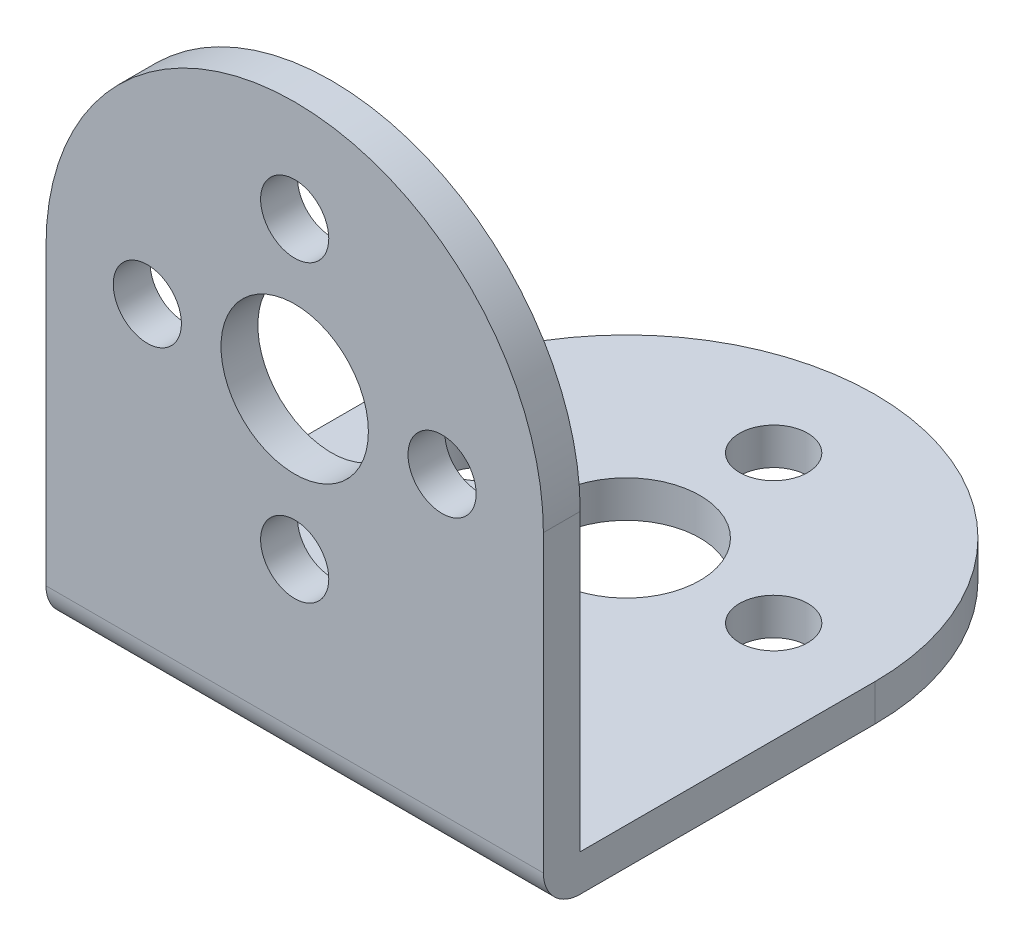
ISO-10303-21;
HEADER;
FILE_DESCRIPTION(('STEP AP214'),'2;1');
FILE_NAME('part.step','',(''),(''),'','','');
FILE_SCHEMA(('AUTOMOTIVE_DESIGN { 1 0 10303 214 1 1 1 1 }'));
ENDSEC;
DATA;
#1=APPLICATION_CONTEXT('core data for automotive mechanical design processes');
#2=APPLICATION_PROTOCOL_DEFINITION('international standard','automotive_design',2000,#1);
#3=PRODUCT_CONTEXT('',#1,'mechanical');
#4=PRODUCT('Part','Part','',(#3));
#5=PRODUCT_RELATED_PRODUCT_CATEGORY('part','',(#4));
#6=PRODUCT_DEFINITION_FORMATION('','',#4);
#7=PRODUCT_DEFINITION_CONTEXT('part definition',#1,'design');
#8=PRODUCT_DEFINITION('design','',#6,#7);
#9=PRODUCT_DEFINITION_SHAPE('','',#8);
#10=(LENGTH_UNIT() NAMED_UNIT(*) SI_UNIT(.MILLI.,.METRE.));
#11=(NAMED_UNIT(*) PLANE_ANGLE_UNIT() SI_UNIT($,.RADIAN.));
#12=(NAMED_UNIT(*) SI_UNIT($,.STERADIAN.) SOLID_ANGLE_UNIT());
#13=UNCERTAINTY_MEASURE_WITH_UNIT(LENGTH_MEASURE(1.E-05),#10,'distance_accuracy_value','');
#14=(GEOMETRIC_REPRESENTATION_CONTEXT(3) GLOBAL_UNCERTAINTY_ASSIGNED_CONTEXT((#13)) GLOBAL_UNIT_ASSIGNED_CONTEXT((#10,
#11,#12)) REPRESENTATION_CONTEXT('',''));
#15=CARTESIAN_POINT('',(0.,0.,0.));
#16=DIRECTION('',(0.,0.,1.));
#17=DIRECTION('',(1.,0.,0.));
#18=AXIS2_PLACEMENT_3D('',#15,#16,#17);
#19=CARTESIAN_POINT('',(0.,0.,-18.));
#20=DIRECTION('',(0.,1.,0.));
#21=DIRECTION('',(0.,0.,1.));
#22=AXIS2_PLACEMENT_3D('',#19,#20,#21);
#23=CYLINDRICAL_SURFACE('',#22,4.);
#24=CARTESIAN_POINT('',(0.,0.,-18.));
#25=DIRECTION('',(0.,1.,0.));
#26=DIRECTION('',(0.,0.,1.));
#27=AXIS2_PLACEMENT_3D('',#24,#25,#26);
#28=CIRCLE('',#27,4.);
#29=CARTESIAN_POINT('',(0.,0.,-14.));
#30=VERTEX_POINT('',#29);
#31=EDGE_CURVE('E19',#30,#30,#28,.T.);
#32=ORIENTED_EDGE('',*,*,#31,.F.);
#33=EDGE_LOOP('',(#32));
#34=FACE_BOUND('',#33,.T.);
#35=CARTESIAN_POINT('',(0.,2.,-18.));
#36=DIRECTION('',(0.,1.,0.));
#37=DIRECTION('',(0.,0.,1.));
#38=AXIS2_PLACEMENT_3D('',#35,#36,#37);
#39=CIRCLE('',#38,4.);
#40=CARTESIAN_POINT('',(0.,2.,-14.));
#41=VERTEX_POINT('',#40);
#42=EDGE_CURVE('E160',#41,#41,#39,.F.);
#43=ORIENTED_EDGE('',*,*,#42,.F.);
#44=EDGE_LOOP('',(#43));
#45=FACE_BOUND('',#44,.T.);
#46=ADVANCED_FACE('F16',(#34,#45),#23,.F.);
#47=CARTESIAN_POINT('',(0.,0.,-26.));
#48=DIRECTION('',(0.,1.,0.));
#49=DIRECTION('',(0.,0.,1.));
#50=AXIS2_PLACEMENT_3D('',#47,#48,#49);
#51=CYLINDRICAL_SURFACE('',#50,1.85);
#52=CARTESIAN_POINT('',(0.,0.,-26.));
#53=DIRECTION('',(0.,1.,0.));
#54=DIRECTION('',(0.,0.,1.));
#55=AXIS2_PLACEMENT_3D('',#52,#53,#54);
#56=CIRCLE('',#55,1.85);
#57=CARTESIAN_POINT('',(0.,0.,-24.15));
#58=VERTEX_POINT('',#57);
#59=EDGE_CURVE('E173',#58,#58,#56,.T.);
#60=ORIENTED_EDGE('',*,*,#59,.F.);
#61=EDGE_LOOP('',(#60));
#62=FACE_BOUND('',#61,.T.);
#63=CARTESIAN_POINT('',(0.,2.,-26.));
#64=DIRECTION('',(0.,1.,0.));
#65=DIRECTION('',(0.,0.,1.));
#66=AXIS2_PLACEMENT_3D('',#63,#64,#65);
#67=CIRCLE('',#66,1.85);
#68=CARTESIAN_POINT('',(0.,2.,-24.15));
#69=VERTEX_POINT('',#68);
#70=EDGE_CURVE('E157',#69,#69,#67,.F.);
#71=ORIENTED_EDGE('',*,*,#70,.F.);
#72=EDGE_LOOP('',(#71));
#73=FACE_BOUND('',#72,.T.);
#74=ADVANCED_FACE('F183',(#62,#73),#51,.F.);
#75=CARTESIAN_POINT('',(8.,0.,-18.));
#76=DIRECTION('',(0.,1.,0.));
#77=DIRECTION('',(0.,0.,1.));
#78=AXIS2_PLACEMENT_3D('',#75,#76,#77);
#79=CYLINDRICAL_SURFACE('',#78,1.85);
#80=CARTESIAN_POINT('',(8.,0.,-18.));
#81=DIRECTION('',(0.,1.,0.));
#82=DIRECTION('',(0.,0.,1.));
#83=AXIS2_PLACEMENT_3D('',#80,#81,#82);
#84=CIRCLE('',#83,1.85);
#85=CARTESIAN_POINT('',(8.,0.,-16.15));
#86=VERTEX_POINT('',#85);
#87=EDGE_CURVE('E171',#86,#86,#84,.T.);
#88=ORIENTED_EDGE('',*,*,#87,.F.);
#89=EDGE_LOOP('',(#88));
#90=FACE_BOUND('',#89,.T.);
#91=CARTESIAN_POINT('',(8.,2.,-18.));
#92=DIRECTION('',(0.,1.,0.));
#93=DIRECTION('',(0.,0.,1.));
#94=AXIS2_PLACEMENT_3D('',#91,#92,#93);
#95=CIRCLE('',#94,1.85);
#96=CARTESIAN_POINT('',(8.,2.,-16.15));
#97=VERTEX_POINT('',#96);
#98=EDGE_CURVE('E154',#97,#97,#95,.F.);
#99=ORIENTED_EDGE('',*,*,#98,.F.);
#100=EDGE_LOOP('',(#99));
#101=FACE_BOUND('',#100,.T.);
#102=ADVANCED_FACE('F365',(#90,#101),#79,.F.);
#103=CARTESIAN_POINT('',(0.,0.,-10.));
#104=DIRECTION('',(0.,1.,0.));
#105=DIRECTION('',(0.,0.,1.));
#106=AXIS2_PLACEMENT_3D('',#103,#104,#105);
#107=CYLINDRICAL_SURFACE('',#106,1.85);
#108=CARTESIAN_POINT('',(0.,0.,-10.));
#109=DIRECTION('',(0.,1.,0.));
#110=DIRECTION('',(0.,0.,1.));
#111=AXIS2_PLACEMENT_3D('',#108,#109,#110);
#112=CIRCLE('',#111,1.85);
#113=CARTESIAN_POINT('',(0.,0.,-8.15));
#114=VERTEX_POINT('',#113);
#115=EDGE_CURVE('E168',#114,#114,#112,.T.);
#116=ORIENTED_EDGE('',*,*,#115,.F.);
#117=EDGE_LOOP('',(#116));
#118=FACE_BOUND('',#117,.T.);
#119=CARTESIAN_POINT('',(0.,2.,-10.));
#120=DIRECTION('',(0.,1.,0.));
#121=DIRECTION('',(0.,0.,1.));
#122=AXIS2_PLACEMENT_3D('',#119,#120,#121);
#123=CIRCLE('',#122,1.85);
#124=CARTESIAN_POINT('',(0.,2.,-8.15));
#125=VERTEX_POINT('',#124);
#126=EDGE_CURVE('E151',#125,#125,#123,.F.);
#127=ORIENTED_EDGE('',*,*,#126,.F.);
#128=EDGE_LOOP('',(#127));
#129=FACE_BOUND('',#128,.T.);
#130=ADVANCED_FACE('F356',(#118,#129),#107,.F.);
#131=CARTESIAN_POINT('',(-8.,0.,-18.));
#132=DIRECTION('',(0.,1.,0.));
#133=DIRECTION('',(0.,0.,1.));
#134=AXIS2_PLACEMENT_3D('',#131,#132,#133);
#135=CYLINDRICAL_SURFACE('',#134,1.85);
#136=CARTESIAN_POINT('',(-8.,0.,-18.));
#137=DIRECTION('',(0.,1.,0.));
#138=DIRECTION('',(0.,0.,1.));
#139=AXIS2_PLACEMENT_3D('',#136,#137,#138);
#140=CIRCLE('',#139,1.85);
#141=CARTESIAN_POINT('',(-8.,0.,-16.15));
#142=VERTEX_POINT('',#141);
#143=EDGE_CURVE('E85',#142,#142,#140,.T.);
#144=ORIENTED_EDGE('',*,*,#143,.F.);
#145=EDGE_LOOP('',(#144));
#146=FACE_BOUND('',#145,.T.);
#147=CARTESIAN_POINT('',(-8.,2.,-18.));
#148=DIRECTION('',(0.,1.,0.));
#149=DIRECTION('',(0.,0.,1.));
#150=AXIS2_PLACEMENT_3D('',#147,#148,#149);
#151=CIRCLE('',#150,1.85);
#152=CARTESIAN_POINT('',(-8.,2.,-16.15));
#153=VERTEX_POINT('',#152);
#154=EDGE_CURVE('E148',#153,#153,#151,.F.);
#155=ORIENTED_EDGE('',*,*,#154,.F.);
#156=EDGE_LOOP('',(#155));
#157=FACE_BOUND('',#156,.T.);
#158=ADVANCED_FACE('F347',(#146,#157),#135,.F.);
#159=CARTESIAN_POINT('',(-13.5,0.,0.));
#160=DIRECTION('',(0.,-1.,0.));
#161=DIRECTION('',(0.,0.,-1.));
#162=AXIS2_PLACEMENT_3D('',#159,#160,#161);
#163=PLANE('',#162);
#164=ORIENTED_EDGE('',*,*,#143,.T.);
#165=EDGE_LOOP('',(#164));
#166=FACE_BOUND('',#165,.T.);
#167=ORIENTED_EDGE('',*,*,#115,.T.);
#168=EDGE_LOOP('',(#167));
#169=FACE_BOUND('',#168,.T.);
#170=ORIENTED_EDGE('',*,*,#87,.T.);
#171=EDGE_LOOP('',(#170));
#172=FACE_BOUND('',#171,.T.);
#173=ORIENTED_EDGE('',*,*,#59,.T.);
#174=EDGE_LOOP('',(#173));
#175=FACE_BOUND('',#174,.T.);
#176=ORIENTED_EDGE('',*,*,#31,.T.);
#177=EDGE_LOOP('',(#176));
#178=FACE_BOUND('',#177,.T.);
#179=CARTESIAN_POINT('',(0.,0.,-18.));
#180=DIRECTION('',(0.,1.,0.));
#181=DIRECTION('',(0.,0.,1.));
#182=AXIS2_PLACEMENT_3D('',#179,#180,#181);
#183=CIRCLE('',#182,13.5);
#184=CARTESIAN_POINT('',(13.5,0.,-18.));
#185=VERTEX_POINT('',#184);
#186=CARTESIAN_POINT('',(-13.5,0.,-18.));
#187=VERTEX_POINT('',#186);
#188=EDGE_CURVE('E74',#185,#187,#183,.T.);
#189=ORIENTED_EDGE('',*,*,#188,.F.);
#190=DIRECTION('',(0.,0.,-1.));
#191=VECTOR('',#190,1.);
#192=CARTESIAN_POINT('',(13.5,0.,0.));
#193=LINE('',#192,#191);
#194=CARTESIAN_POINT('',(13.5,0.,-2.));
#195=VERTEX_POINT('',#194);
#196=EDGE_CURVE('E78',#195,#185,#193,.T.);
#197=ORIENTED_EDGE('',*,*,#196,.F.);
#198=DIRECTION('',(-1.,0.,0.));
#199=VECTOR('',#198,1.);
#200=CARTESIAN_POINT('',(48.6972,0.,-2.));
#201=LINE('',#200,#199);
#202=CARTESIAN_POINT('',(-13.5,0.,-2.));
#203=VERTEX_POINT('',#202);
#204=EDGE_CURVE('E84',#203,#195,#201,.F.);
#205=ORIENTED_EDGE('',*,*,#204,.F.);
#206=DIRECTION('',(0.,0.,-1.));
#207=VECTOR('',#206,1.);
#208=CARTESIAN_POINT('',(-13.5,0.,0.));
#209=LINE('',#208,#207);
#210=EDGE_CURVE('E81',#203,#187,#209,.T.);
#211=ORIENTED_EDGE('',*,*,#210,.T.);
#212=EDGE_LOOP('',(#189,#197,#205,#211));
#213=FACE_BOUND('',#212,.T.);
#214=ADVANCED_FACE('F76',(#166,#169,#172,#175,#178,#213),#163,.T.);
#215=CARTESIAN_POINT('',(0.,-41.0634,-18.));
#216=DIRECTION('',(0.,1.,0.));
#217=DIRECTION('',(0.,0.,1.));
#218=AXIS2_PLACEMENT_3D('',#215,#216,#217);
#219=CYLINDRICAL_SURFACE('',#218,13.5);
#220=ORIENTED_EDGE('',*,*,#188,.T.);
#221=DIRECTION('',(0.,1.,0.));
#222=VECTOR('',#221,1.);
#223=CARTESIAN_POINT('',(-13.5,0.,-18.));
#224=LINE('',#223,#222);
#225=CARTESIAN_POINT('',(-13.5,2.,-18.));
#226=VERTEX_POINT('',#225);
#227=EDGE_CURVE('E111',#187,#226,#224,.T.);
#228=ORIENTED_EDGE('',*,*,#227,.T.);
#229=CARTESIAN_POINT('',(0.,2.,-18.));
#230=DIRECTION('',(0.,1.,0.));
#231=DIRECTION('',(0.,0.,1.));
#232=AXIS2_PLACEMENT_3D('',#229,#230,#231);
#233=CIRCLE('',#232,13.5);
#234=CARTESIAN_POINT('',(13.5,2.,-18.));
#235=VERTEX_POINT('',#234);
#236=EDGE_CURVE('E90',#235,#226,#233,.T.);
#237=ORIENTED_EDGE('',*,*,#236,.F.);
#238=DIRECTION('',(0.,1.,0.));
#239=VECTOR('',#238,1.);
#240=CARTESIAN_POINT('',(13.5,0.,-18.));
#241=LINE('',#240,#239);
#242=EDGE_CURVE('E88',#185,#235,#241,.T.);
#243=ORIENTED_EDGE('',*,*,#242,.F.);
#244=EDGE_LOOP('',(#220,#228,#237,#243));
#245=FACE_BOUND('',#244,.T.);
#246=ADVANCED_FACE('F89',(#245),#219,.T.);
#247=CARTESIAN_POINT('',(48.6972,2.,-2.));
#248=DIRECTION('',(-1.,0.,0.));
#249=DIRECTION('',(0.,0.,1.));
#250=AXIS2_PLACEMENT_3D('',#247,#248,#249);
#251=CYLINDRICAL_SURFACE('',#250,2.);
#252=CARTESIAN_POINT('',(13.5,2.,-2.));
#253=DIRECTION('',(-1.,0.,0.));
#254=DIRECTION('',(0.,0.,1.));
#255=AXIS2_PLACEMENT_3D('',#252,#253,#254);
#256=CIRCLE('',#255,2.);
#257=CARTESIAN_POINT('',(13.5,2.,0.));
#258=VERTEX_POINT('',#257);
#259=EDGE_CURVE('E98',#258,#195,#256,.F.);
#260=ORIENTED_EDGE('',*,*,#259,.F.);
#261=DIRECTION('',(1.,0.,0.));
#262=VECTOR('',#261,1.);
#263=CARTESIAN_POINT('',(-13.5,2.,0.));
#264=LINE('',#263,#262);
#265=CARTESIAN_POINT('',(-13.5,2.,0.));
#266=VERTEX_POINT('',#265);
#267=EDGE_CURVE('E108',#266,#258,#264,.T.);
#268=ORIENTED_EDGE('',*,*,#267,.F.);
#269=CARTESIAN_POINT('',(-13.5,2.,-2.));
#270=DIRECTION('',(-1.,0.,0.));
#271=DIRECTION('',(0.,0.,1.));
#272=AXIS2_PLACEMENT_3D('',#269,#270,#271);
#273=CIRCLE('',#272,2.);
#274=EDGE_CURVE('E144',#266,#203,#273,.F.);
#275=ORIENTED_EDGE('',*,*,#274,.T.);
#276=ORIENTED_EDGE('',*,*,#204,.T.);
#277=EDGE_LOOP('',(#260,#268,#275,#276));
#278=FACE_BOUND('',#277,.T.);
#279=ADVANCED_FACE('F218',(#278),#251,.T.);
#280=CARTESIAN_POINT('',(-13.5,31.5,0.));
#281=DIRECTION('',(0.,0.,1.));
#282=DIRECTION('',(1.,0.,0.));
#283=AXIS2_PLACEMENT_3D('',#280,#281,#282);
#284=PLANE('',#283);
#285=CARTESIAN_POINT('',(-8.,18.,0.));
#286=DIRECTION('',(0.,0.,1.));
#287=DIRECTION('',(1.,0.,0.));
#288=AXIS2_PLACEMENT_3D('',#285,#286,#287);
#289=CIRCLE('',#288,1.85);
#290=CARTESIAN_POINT('',(-6.15,18.,0.));
#291=VERTEX_POINT('',#290);
#292=EDGE_CURVE('E129',#291,#291,#289,.F.);
#293=ORIENTED_EDGE('',*,*,#292,.T.);
#294=EDGE_LOOP('',(#293));
#295=FACE_BOUND('',#294,.T.);
#296=CARTESIAN_POINT('',(0.,10.,0.));
#297=DIRECTION('',(0.,0.,1.));
#298=DIRECTION('',(1.,0.,0.));
#299=AXIS2_PLACEMENT_3D('',#296,#297,#298);
#300=CIRCLE('',#299,1.85);
#301=CARTESIAN_POINT('',(1.85,10.,0.));
#302=VERTEX_POINT('',#301);
#303=EDGE_CURVE('E132',#302,#302,#300,.F.);
#304=ORIENTED_EDGE('',*,*,#303,.T.);
#305=EDGE_LOOP('',(#304));
#306=FACE_BOUND('',#305,.T.);
#307=CARTESIAN_POINT('',(8.,18.,0.));
#308=DIRECTION('',(0.,0.,1.));
#309=DIRECTION('',(1.,0.,0.));
#310=AXIS2_PLACEMENT_3D('',#307,#308,#309);
#311=CIRCLE('',#310,1.85);
#312=CARTESIAN_POINT('',(9.85,18.,0.));
#313=VERTEX_POINT('',#312);
#314=EDGE_CURVE('E135',#313,#313,#311,.F.);
#315=ORIENTED_EDGE('',*,*,#314,.T.);
#316=EDGE_LOOP('',(#315));
#317=FACE_BOUND('',#316,.T.);
#318=CARTESIAN_POINT('',(0.,26.,0.));
#319=DIRECTION('',(0.,0.,1.));
#320=DIRECTION('',(1.,0.,0.));
#321=AXIS2_PLACEMENT_3D('',#318,#319,#320);
#322=CIRCLE('',#321,1.85);
#323=CARTESIAN_POINT('',(1.85,26.,0.));
#324=VERTEX_POINT('',#323);
#325=EDGE_CURVE('E138',#324,#324,#322,.F.);
#326=ORIENTED_EDGE('',*,*,#325,.T.);
#327=EDGE_LOOP('',(#326));
#328=FACE_BOUND('',#327,.T.);
#329=CARTESIAN_POINT('',(0.,18.,0.));
#330=DIRECTION('',(0.,0.,1.));
#331=DIRECTION('',(1.,0.,0.));
#332=AXIS2_PLACEMENT_3D('',#329,#330,#331);
#333=CIRCLE('',#332,4.);
#334=CARTESIAN_POINT('',(4.,18.,0.));
#335=VERTEX_POINT('',#334);
#336=EDGE_CURVE('E141',#335,#335,#333,.F.);
#337=ORIENTED_EDGE('',*,*,#336,.T.);
#338=EDGE_LOOP('',(#337));
#339=FACE_BOUND('',#338,.T.);
#340=CARTESIAN_POINT('',(0.,18.,0.));
#341=DIRECTION('',(0.,0.,1.));
#342=DIRECTION('',(1.,0.,0.));
#343=AXIS2_PLACEMENT_3D('',#340,#341,#342);
#344=CIRCLE('',#343,13.5);
#345=CARTESIAN_POINT('',(-13.5,18.,0.));
#346=VERTEX_POINT('',#345);
#347=CARTESIAN_POINT('',(13.5,18.,0.));
#348=VERTEX_POINT('',#347);
#349=EDGE_CURVE('E100',#346,#348,#344,.F.);
#350=ORIENTED_EDGE('',*,*,#349,.F.);
#351=DIRECTION('',(0.,1.,0.));
#352=VECTOR('',#351,1.);
#353=CARTESIAN_POINT('',(-13.5,0.,0.));
#354=LINE('',#353,#352);
#355=EDGE_CURVE('E147',#346,#266,#354,.F.);
#356=ORIENTED_EDGE('',*,*,#355,.T.);
#357=ORIENTED_EDGE('',*,*,#267,.T.);
#358=DIRECTION('',(0.,1.,0.));
#359=VECTOR('',#358,1.);
#360=CARTESIAN_POINT('',(13.5,0.,0.));
#361=LINE('',#360,#359);
#362=EDGE_CURVE('E104',#348,#258,#361,.F.);
#363=ORIENTED_EDGE('',*,*,#362,.F.);
#364=EDGE_LOOP('',(#350,#356,#357,#363));
#365=FACE_BOUND('',#364,.T.);
#366=ADVANCED_FACE('F216',(#295,#306,#317,#328,#339,#365),#284,.T.);
#367=CARTESIAN_POINT('',(0.,18.,-72.5634));
#368=DIRECTION('',(0.,0.,1.));
#369=DIRECTION('',(1.,0.,0.));
#370=AXIS2_PLACEMENT_3D('',#367,#368,#369);
#371=CYLINDRICAL_SURFACE('',#370,13.5);
#372=CARTESIAN_POINT('',(0.,18.,-2.));
#373=DIRECTION('',(0.,0.,1.));
#374=DIRECTION('',(1.,0.,0.));
#375=AXIS2_PLACEMENT_3D('',#372,#373,#374);
#376=CIRCLE('',#375,13.5);
#377=CARTESIAN_POINT('',(-13.5,18.,-2.));
#378=VERTEX_POINT('',#377);
#379=CARTESIAN_POINT('',(13.5,18.,-2.));
#380=VERTEX_POINT('',#379);
#381=EDGE_CURVE('E125',#378,#380,#376,.F.);
#382=ORIENTED_EDGE('',*,*,#381,.F.);
#383=DIRECTION('',(0.,0.,-1.));
#384=VECTOR('',#383,1.);
#385=CARTESIAN_POINT('',(-13.5,18.,0.));
#386=LINE('',#385,#384);
#387=EDGE_CURVE('E204',#378,#346,#386,.F.);
#388=ORIENTED_EDGE('',*,*,#387,.T.);
#389=ORIENTED_EDGE('',*,*,#349,.T.);
#390=DIRECTION('',(0.,0.,-1.));
#391=VECTOR('',#390,1.);
#392=CARTESIAN_POINT('',(13.5,18.,0.));
#393=LINE('',#392,#391);
#394=EDGE_CURVE('E93',#380,#348,#393,.F.);
#395=ORIENTED_EDGE('',*,*,#394,.F.);
#396=EDGE_LOOP('',(#382,#388,#389,#395));
#397=FACE_BOUND('',#396,.T.);
#398=ADVANCED_FACE('F211',(#397),#371,.T.);
#399=CARTESIAN_POINT('',(13.5,0.,0.));
#400=DIRECTION('',(1.,0.,0.));
#401=DIRECTION('',(0.,0.,-1.));
#402=AXIS2_PLACEMENT_3D('',#399,#400,#401);
#403=PLANE('',#402);
#404=ORIENTED_EDGE('',*,*,#394,.T.);
#405=ORIENTED_EDGE('',*,*,#362,.T.);
#406=ORIENTED_EDGE('',*,*,#259,.T.);
#407=ORIENTED_EDGE('',*,*,#196,.T.);
#408=ORIENTED_EDGE('',*,*,#242,.T.);
#409=DIRECTION('',(0.,0.,1.));
#410=VECTOR('',#409,1.);
#411=CARTESIAN_POINT('',(13.5,2.,-31.5));
#412=LINE('',#411,#410);
#413=CARTESIAN_POINT('',(13.5,2.,-2.));
#414=VERTEX_POINT('',#413);
#415=EDGE_CURVE('E163',#414,#235,#412,.F.);
#416=ORIENTED_EDGE('',*,*,#415,.F.);
#417=DIRECTION('',(0.,1.,0.));
#418=VECTOR('',#417,1.);
#419=CARTESIAN_POINT('',(13.5,2.,-2.));
#420=LINE('',#419,#418);
#421=EDGE_CURVE('E128',#380,#414,#420,.F.);
#422=ORIENTED_EDGE('',*,*,#421,.F.);
#423=EDGE_LOOP('',(#404,#405,#406,#407,#408,#416,#422));
#424=FACE_BOUND('',#423,.T.);
#425=ADVANCED_FACE('F96',(#424),#403,.T.);
#426=CARTESIAN_POINT('',(-13.5,2.,-31.5));
#427=DIRECTION('',(0.,1.,0.));
#428=DIRECTION('',(0.,0.,1.));
#429=AXIS2_PLACEMENT_3D('',#426,#427,#428);
#430=PLANE('',#429);
#431=ORIENTED_EDGE('',*,*,#154,.T.);
#432=EDGE_LOOP('',(#431));
#433=FACE_BOUND('',#432,.T.);
#434=ORIENTED_EDGE('',*,*,#126,.T.);
#435=EDGE_LOOP('',(#434));
#436=FACE_BOUND('',#435,.T.);
#437=ORIENTED_EDGE('',*,*,#98,.T.);
#438=EDGE_LOOP('',(#437));
#439=FACE_BOUND('',#438,.T.);
#440=ORIENTED_EDGE('',*,*,#70,.T.);
#441=EDGE_LOOP('',(#440));
#442=FACE_BOUND('',#441,.T.);
#443=ORIENTED_EDGE('',*,*,#42,.T.);
#444=EDGE_LOOP('',(#443));
#445=FACE_BOUND('',#444,.T.);
#446=DIRECTION('',(-1.,0.,0.));
#447=VECTOR('',#446,1.);
#448=CARTESIAN_POINT('',(-13.5,2.,-2.));
#449=LINE('',#448,#447);
#450=CARTESIAN_POINT('',(-13.5,2.,-2.));
#451=VERTEX_POINT('',#450);
#452=EDGE_CURVE('E192',#414,#451,#449,.T.);
#453=ORIENTED_EDGE('',*,*,#452,.F.);
#454=ORIENTED_EDGE('',*,*,#415,.T.);
#455=ORIENTED_EDGE('',*,*,#236,.T.);
#456=DIRECTION('',(0.,0.,-1.));
#457=VECTOR('',#456,1.);
#458=CARTESIAN_POINT('',(-13.5,2.,0.));
#459=LINE('',#458,#457);
#460=EDGE_CURVE('E34',#226,#451,#459,.F.);
#461=ORIENTED_EDGE('',*,*,#460,.T.);
#462=EDGE_LOOP('',(#453,#454,#455,#461));
#463=FACE_BOUND('',#462,.T.);
#464=ADVANCED_FACE('F186',(#433,#436,#439,#442,#445,#463),#430,.T.);
#465=CARTESIAN_POINT('',(-13.5,0.,0.));
#466=DIRECTION('',(1.,0.,0.));
#467=DIRECTION('',(0.,0.,-1.));
#468=AXIS2_PLACEMENT_3D('',#465,#466,#467);
#469=PLANE('',#468);
#470=ORIENTED_EDGE('',*,*,#355,.F.);
#471=ORIENTED_EDGE('',*,*,#387,.F.);
#472=DIRECTION('',(0.,1.,0.));
#473=VECTOR('',#472,1.);
#474=CARTESIAN_POINT('',(-13.5,2.,-2.));
#475=LINE('',#474,#473);
#476=EDGE_CURVE('E124',#451,#378,#475,.T.);
#477=ORIENTED_EDGE('',*,*,#476,.F.);
#478=ORIENTED_EDGE('',*,*,#460,.F.);
#479=ORIENTED_EDGE('',*,*,#227,.F.);
#480=ORIENTED_EDGE('',*,*,#210,.F.);
#481=ORIENTED_EDGE('',*,*,#274,.F.);
#482=EDGE_LOOP('',(#470,#471,#477,#478,#479,#480,#481));
#483=FACE_BOUND('',#482,.T.);
#484=ADVANCED_FACE('F188',(#483),#469,.F.);
#485=CARTESIAN_POINT('',(0.,18.,0.));
#486=DIRECTION('',(0.,0.,1.));
#487=DIRECTION('',(1.,0.,0.));
#488=AXIS2_PLACEMENT_3D('',#485,#486,#487);
#489=CYLINDRICAL_SURFACE('',#488,4.);
#490=CARTESIAN_POINT('',(0.,18.,-2.));
#491=DIRECTION('',(0.,0.,1.));
#492=DIRECTION('',(1.,0.,0.));
#493=AXIS2_PLACEMENT_3D('',#490,#491,#492);
#494=CIRCLE('',#493,4.);
#495=CARTESIAN_POINT('',(4.,18.,-2.));
#496=VERTEX_POINT('',#495);
#497=EDGE_CURVE('E121',#496,#496,#494,.T.);
#498=ORIENTED_EDGE('',*,*,#497,.F.);
#499=EDGE_LOOP('',(#498));
#500=FACE_BOUND('',#499,.T.);
#501=ORIENTED_EDGE('',*,*,#336,.F.);
#502=EDGE_LOOP('',(#501));
#503=FACE_BOUND('',#502,.T.);
#504=ADVANCED_FACE('F251',(#500,#503),#489,.F.);
#505=CARTESIAN_POINT('',(0.,26.,0.));
#506=DIRECTION('',(0.,0.,1.));
#507=DIRECTION('',(1.,0.,0.));
#508=AXIS2_PLACEMENT_3D('',#505,#506,#507);
#509=CYLINDRICAL_SURFACE('',#508,1.85);
#510=CARTESIAN_POINT('',(0.,26.,-2.));
#511=DIRECTION('',(0.,0.,1.));
#512=DIRECTION('',(1.,0.,0.));
#513=AXIS2_PLACEMENT_3D('',#510,#511,#512);
#514=CIRCLE('',#513,1.85);
#515=CARTESIAN_POINT('',(1.85,26.,-2.));
#516=VERTEX_POINT('',#515);
#517=EDGE_CURVE('E118',#516,#516,#514,.T.);
#518=ORIENTED_EDGE('',*,*,#517,.F.);
#519=EDGE_LOOP('',(#518));
#520=FACE_BOUND('',#519,.T.);
#521=ORIENTED_EDGE('',*,*,#325,.F.);
#522=EDGE_LOOP('',(#521));
#523=FACE_BOUND('',#522,.T.);
#524=ADVANCED_FACE('F247',(#520,#523),#509,.F.);
#525=CARTESIAN_POINT('',(8.,18.,0.));
#526=DIRECTION('',(0.,0.,1.));
#527=DIRECTION('',(1.,0.,0.));
#528=AXIS2_PLACEMENT_3D('',#525,#526,#527);
#529=CYLINDRICAL_SURFACE('',#528,1.85);
#530=CARTESIAN_POINT('',(8.,18.,-2.));
#531=DIRECTION('',(0.,0.,1.));
#532=DIRECTION('',(1.,0.,0.));
#533=AXIS2_PLACEMENT_3D('',#530,#531,#532);
#534=CIRCLE('',#533,1.85);
#535=CARTESIAN_POINT('',(9.85,18.,-2.));
#536=VERTEX_POINT('',#535);
#537=EDGE_CURVE('E115',#536,#536,#534,.T.);
#538=ORIENTED_EDGE('',*,*,#537,.F.);
#539=EDGE_LOOP('',(#538));
#540=FACE_BOUND('',#539,.T.);
#541=ORIENTED_EDGE('',*,*,#314,.F.);
#542=EDGE_LOOP('',(#541));
#543=FACE_BOUND('',#542,.T.);
#544=ADVANCED_FACE('F243',(#540,#543),#529,.F.);
#545=CARTESIAN_POINT('',(0.,10.,0.));
#546=DIRECTION('',(0.,0.,1.));
#547=DIRECTION('',(1.,0.,0.));
#548=AXIS2_PLACEMENT_3D('',#545,#546,#547);
#549=CYLINDRICAL_SURFACE('',#548,1.85);
#550=CARTESIAN_POINT('',(0.,10.,-2.));
#551=DIRECTION('',(0.,0.,1.));
#552=DIRECTION('',(1.,0.,0.));
#553=AXIS2_PLACEMENT_3D('',#550,#551,#552);
#554=CIRCLE('',#553,1.85);
#555=CARTESIAN_POINT('',(1.85,10.,-2.));
#556=VERTEX_POINT('',#555);
#557=EDGE_CURVE('E25',#556,#556,#554,.T.);
#558=ORIENTED_EDGE('',*,*,#557,.F.);
#559=EDGE_LOOP('',(#558));
#560=FACE_BOUND('',#559,.T.);
#561=ORIENTED_EDGE('',*,*,#303,.F.);
#562=EDGE_LOOP('',(#561));
#563=FACE_BOUND('',#562,.T.);
#564=ADVANCED_FACE('F236',(#560,#563),#549,.F.);
#565=CARTESIAN_POINT('',(-8.,18.,0.));
#566=DIRECTION('',(0.,0.,1.));
#567=DIRECTION('',(1.,0.,0.));
#568=AXIS2_PLACEMENT_3D('',#565,#566,#567);
#569=CYLINDRICAL_SURFACE('',#568,1.85);
#570=CARTESIAN_POINT('',(-8.,18.,-2.));
#571=DIRECTION('',(0.,0.,1.));
#572=DIRECTION('',(1.,0.,0.));
#573=AXIS2_PLACEMENT_3D('',#570,#571,#572);
#574=CIRCLE('',#573,1.85);
#575=CARTESIAN_POINT('',(-6.15,18.,-2.));
#576=VERTEX_POINT('',#575);
#577=EDGE_CURVE('E10',#576,#576,#574,.T.);
#578=ORIENTED_EDGE('',*,*,#577,.F.);
#579=EDGE_LOOP('',(#578));
#580=FACE_BOUND('',#579,.T.);
#581=ORIENTED_EDGE('',*,*,#292,.F.);
#582=EDGE_LOOP('',(#581));
#583=FACE_BOUND('',#582,.T.);
#584=ADVANCED_FACE('F230',(#580,#583),#569,.F.);
#585=CARTESIAN_POINT('',(-13.5,2.,-2.));
#586=DIRECTION('',(0.,0.,-1.));
#587=DIRECTION('',(-1.,0.,0.));
#588=AXIS2_PLACEMENT_3D('',#585,#586,#587);
#589=PLANE('',#588);
#590=ORIENTED_EDGE('',*,*,#577,.T.);
#591=EDGE_LOOP('',(#590));
#592=FACE_BOUND('',#591,.T.);
#593=ORIENTED_EDGE('',*,*,#557,.T.);
#594=EDGE_LOOP('',(#593));
#595=FACE_BOUND('',#594,.T.);
#596=ORIENTED_EDGE('',*,*,#537,.T.);
#597=EDGE_LOOP('',(#596));
#598=FACE_BOUND('',#597,.T.);
#599=ORIENTED_EDGE('',*,*,#517,.T.);
#600=EDGE_LOOP('',(#599));
#601=FACE_BOUND('',#600,.T.);
#602=ORIENTED_EDGE('',*,*,#497,.T.);
#603=EDGE_LOOP('',(#602));
#604=FACE_BOUND('',#603,.T.);
#605=ORIENTED_EDGE('',*,*,#452,.T.);
#606=ORIENTED_EDGE('',*,*,#476,.T.);
#607=ORIENTED_EDGE('',*,*,#381,.T.);
#608=ORIENTED_EDGE('',*,*,#421,.T.);
#609=EDGE_LOOP('',(#605,#606,#607,#608));
#610=FACE_BOUND('',#609,.T.);
#611=ADVANCED_FACE('F198',(#592,#595,#598,#601,#604,#610),#589,.T.);
#612=CLOSED_SHELL('',(#46,#74,#102,#130,#158,#214,#246,#279,#366,#398,#425,#464,#484,#504,#524,
#544,#564,#584,#611));
#613=MANIFOLD_SOLID_BREP('B1',#612);
#614=ADVANCED_BREP_SHAPE_REPRESENTATION('',(#18,#613),#14);
#615=SHAPE_DEFINITION_REPRESENTATION(#9,#614);
ENDSEC;
END-ISO-10303-21;
